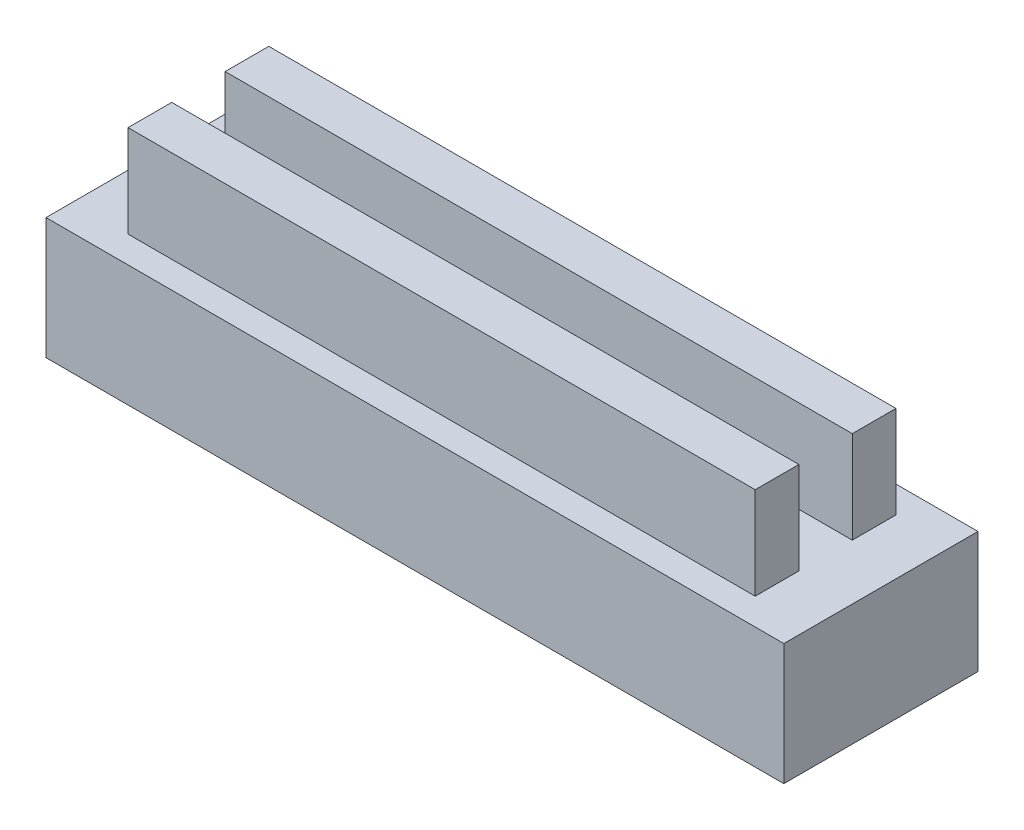
ISO-10303-21;
HEADER;
FILE_DESCRIPTION(('STEP AP214'),'2;1');
FILE_NAME('part.step','',(''),(''),'','','');
FILE_SCHEMA(('AUTOMOTIVE_DESIGN { 1 0 10303 214 1 1 1 1 }'));
ENDSEC;
DATA;
#1=APPLICATION_CONTEXT('core data for automotive mechanical design processes');
#2=APPLICATION_PROTOCOL_DEFINITION('international standard','automotive_design',2000,#1);
#3=PRODUCT_CONTEXT('',#1,'mechanical');
#4=PRODUCT('Part','Part','',(#3));
#5=PRODUCT_RELATED_PRODUCT_CATEGORY('part','',(#4));
#6=PRODUCT_DEFINITION_FORMATION('','',#4);
#7=PRODUCT_DEFINITION_CONTEXT('part definition',#1,'design');
#8=PRODUCT_DEFINITION('design','',#6,#7);
#9=PRODUCT_DEFINITION_SHAPE('','',#8);
#10=(LENGTH_UNIT() NAMED_UNIT(*) SI_UNIT(.MILLI.,.METRE.));
#11=(NAMED_UNIT(*) PLANE_ANGLE_UNIT() SI_UNIT($,.RADIAN.));
#12=(NAMED_UNIT(*) SI_UNIT($,.STERADIAN.) SOLID_ANGLE_UNIT());
#13=UNCERTAINTY_MEASURE_WITH_UNIT(LENGTH_MEASURE(1.E-05),#10,'distance_accuracy_value','');
#14=(GEOMETRIC_REPRESENTATION_CONTEXT(3) GLOBAL_UNCERTAINTY_ASSIGNED_CONTEXT((#13)) GLOBAL_UNIT_ASSIGNED_CONTEXT((#10,
#11,#12)) REPRESENTATION_CONTEXT('',''));
#15=CARTESIAN_POINT('',(0.,0.,0.));
#16=DIRECTION('',(0.,0.,1.));
#17=DIRECTION('',(1.,0.,0.));
#18=AXIS2_PLACEMENT_3D('',#15,#16,#17);
#19=CARTESIAN_POINT('',(0.,2.5,0.));
#20=DIRECTION('',(0.,1.,0.));
#21=DIRECTION('',(0.,0.,1.));
#22=AXIS2_PLACEMENT_3D('',#19,#20,#21);
#23=PLANE('',#22);
#24=DIRECTION('',(0.,0.,1.));
#25=VECTOR('',#24,1.);
#26=CARTESIAN_POINT('',(-7.6,2.5,2.));
#27=LINE('',#26,#25);
#28=CARTESIAN_POINT('',(-7.6,2.5,-2.));
#29=VERTEX_POINT('',#28);
#30=CARTESIAN_POINT('',(-7.6,2.5,2.));
#31=VERTEX_POINT('',#30);
#32=EDGE_CURVE('E180',#29,#31,#27,.T.);
#33=ORIENTED_EDGE('',*,*,#32,.T.);
#34=DIRECTION('',(1.,0.,0.));
#35=VECTOR('',#34,1.);
#36=CARTESIAN_POINT('',(7.6,2.5,2.));
#37=LINE('',#36,#35);
#38=CARTESIAN_POINT('',(7.6,2.5,2.));
#39=VERTEX_POINT('',#38);
#40=EDGE_CURVE('E183',#31,#39,#37,.T.);
#41=ORIENTED_EDGE('',*,*,#40,.T.);
#42=DIRECTION('',(0.,0.,-1.));
#43=VECTOR('',#42,1.);
#44=CARTESIAN_POINT('',(7.6,2.5,2.));
#45=LINE('',#44,#43);
#46=CARTESIAN_POINT('',(7.6,2.5,-2.));
#47=VERTEX_POINT('',#46);
#48=EDGE_CURVE('E186',#39,#47,#45,.T.);
#49=ORIENTED_EDGE('',*,*,#48,.T.);
#50=DIRECTION('',(-1.,0.,0.));
#51=VECTOR('',#50,1.);
#52=CARTESIAN_POINT('',(7.6,2.5,-2.));
#53=LINE('',#52,#51);
#54=EDGE_CURVE('E188',#47,#29,#53,.T.);
#55=ORIENTED_EDGE('',*,*,#54,.T.);
#56=EDGE_LOOP('',(#33,#41,#49,#55));
#57=FACE_BOUND('',#56,.T.);
#58=DIRECTION('',(1.,0.,0.));
#59=VECTOR('',#58,1.);
#60=CARTESIAN_POINT('',(6.46,2.5,1.45));
#61=LINE('',#60,#59);
#62=CARTESIAN_POINT('',(-6.46,2.5,1.45));
#63=VERTEX_POINT('',#62);
#64=CARTESIAN_POINT('',(6.46,2.5,1.45));
#65=VERTEX_POINT('',#64);
#66=EDGE_CURVE('E151',#63,#65,#61,.T.);
#67=ORIENTED_EDGE('',*,*,#66,.F.);
#68=DIRECTION('',(0.,0.,1.));
#69=VECTOR('',#68,1.);
#70=CARTESIAN_POINT('',(-6.46,2.5,1.45));
#71=LINE('',#70,#69);
#72=CARTESIAN_POINT('',(-6.46,2.5,0.550000000000001));
#73=VERTEX_POINT('',#72);
#74=EDGE_CURVE('E148',#73,#63,#71,.T.);
#75=ORIENTED_EDGE('',*,*,#74,.F.);
#76=DIRECTION('',(-1.,0.,0.));
#77=VECTOR('',#76,1.);
#78=CARTESIAN_POINT('',(6.46,2.5,0.550000000000001));
#79=LINE('',#78,#77);
#80=CARTESIAN_POINT('',(6.46,2.5,0.550000000000001));
#81=VERTEX_POINT('',#80);
#82=EDGE_CURVE('E160',#81,#73,#79,.T.);
#83=ORIENTED_EDGE('',*,*,#82,.F.);
#84=DIRECTION('',(0.,0.,-1.));
#85=VECTOR('',#84,1.);
#86=CARTESIAN_POINT('',(6.46,2.5,1.45));
#87=LINE('',#86,#85);
#88=EDGE_CURVE('E168',#65,#81,#87,.T.);
#89=ORIENTED_EDGE('',*,*,#88,.F.);
#90=EDGE_LOOP('',(#67,#75,#83,#89));
#91=FACE_BOUND('',#90,.T.);
#92=DIRECTION('',(1.,0.,0.));
#93=VECTOR('',#92,1.);
#94=CARTESIAN_POINT('',(6.46,2.5,-0.550000000000001));
#95=LINE('',#94,#93);
#96=CARTESIAN_POINT('',(-6.46,2.5,-0.550000000000001));
#97=VERTEX_POINT('',#96);
#98=CARTESIAN_POINT('',(6.46,2.5,-0.550000000000001));
#99=VERTEX_POINT('',#98);
#100=EDGE_CURVE('E369',#97,#99,#95,.T.);
#101=ORIENTED_EDGE('',*,*,#100,.F.);
#102=DIRECTION('',(0.,0.,1.));
#103=VECTOR('',#102,1.);
#104=CARTESIAN_POINT('',(-6.46,2.5,-0.550000000000001));
#105=LINE('',#104,#103);
#106=CARTESIAN_POINT('',(-6.46,2.5,-1.45));
#107=VERTEX_POINT('',#106);
#108=EDGE_CURVE('E146',#107,#97,#105,.T.);
#109=ORIENTED_EDGE('',*,*,#108,.F.);
#110=DIRECTION('',(-1.,0.,0.));
#111=VECTOR('',#110,1.);
#112=CARTESIAN_POINT('',(6.46,2.5,-1.45));
#113=LINE('',#112,#111);
#114=CARTESIAN_POINT('',(6.46,2.5,-1.45));
#115=VERTEX_POINT('',#114);
#116=EDGE_CURVE('E142',#115,#107,#113,.T.);
#117=ORIENTED_EDGE('',*,*,#116,.F.);
#118=DIRECTION('',(0.,0.,-1.));
#119=VECTOR('',#118,1.);
#120=CARTESIAN_POINT('',(6.46,2.5,-0.550000000000001));
#121=LINE('',#120,#119);
#122=EDGE_CURVE('E366',#99,#115,#121,.T.);
#123=ORIENTED_EDGE('',*,*,#122,.F.);
#124=EDGE_LOOP('',(#101,#109,#117,#123));
#125=FACE_BOUND('',#124,.T.);
#126=ADVANCED_FACE('F33',(#57,#91,#125),#23,.T.);
#127=CARTESIAN_POINT('',(-7.6,2.5,2.));
#128=DIRECTION('',(1.,0.,0.));
#129=DIRECTION('',(0.,0.,-1.));
#130=AXIS2_PLACEMENT_3D('',#127,#128,#129);
#131=PLANE('',#130);
#132=DIRECTION('',(0.,0.,1.));
#133=VECTOR('',#132,1.);
#134=CARTESIAN_POINT('',(-7.6,0.,2.));
#135=LINE('',#134,#133);
#136=CARTESIAN_POINT('',(-7.6,0.,-2.));
#137=VERTEX_POINT('',#136);
#138=CARTESIAN_POINT('',(-7.6,0.,2.));
#139=VERTEX_POINT('',#138);
#140=EDGE_CURVE('E179',#137,#139,#135,.T.);
#141=ORIENTED_EDGE('',*,*,#140,.T.);
#142=DIRECTION('',(0.,-1.,0.));
#143=VECTOR('',#142,1.);
#144=CARTESIAN_POINT('',(-7.6,2.5,2.));
#145=LINE('',#144,#143);
#146=EDGE_CURVE('E11',#31,#139,#145,.T.);
#147=ORIENTED_EDGE('',*,*,#146,.F.);
#148=ORIENTED_EDGE('',*,*,#32,.F.);
#149=DIRECTION('',(0.,-1.,0.));
#150=VECTOR('',#149,1.);
#151=CARTESIAN_POINT('',(-7.6,2.5,-2.));
#152=LINE('',#151,#150);
#153=EDGE_CURVE('E190',#29,#137,#152,.T.);
#154=ORIENTED_EDGE('',*,*,#153,.T.);
#155=EDGE_LOOP('',(#141,#147,#148,#154));
#156=FACE_BOUND('',#155,.T.);
#157=ADVANCED_FACE('F35',(#156),#131,.F.);
#158=CARTESIAN_POINT('',(7.6,2.5,2.));
#159=DIRECTION('',(0.,0.,-1.));
#160=DIRECTION('',(-1.,0.,0.));
#161=AXIS2_PLACEMENT_3D('',#158,#159,#160);
#162=PLANE('',#161);
#163=DIRECTION('',(1.,0.,0.));
#164=VECTOR('',#163,1.);
#165=CARTESIAN_POINT('',(7.6,0.,2.));
#166=LINE('',#165,#164);
#167=CARTESIAN_POINT('',(7.6,0.,2.));
#168=VERTEX_POINT('',#167);
#169=EDGE_CURVE('E193',#139,#168,#166,.T.);
#170=ORIENTED_EDGE('',*,*,#169,.T.);
#171=DIRECTION('',(0.,-1.,0.));
#172=VECTOR('',#171,1.);
#173=CARTESIAN_POINT('',(7.6,2.5,2.));
#174=LINE('',#173,#172);
#175=EDGE_CURVE('E41',#39,#168,#174,.T.);
#176=ORIENTED_EDGE('',*,*,#175,.F.);
#177=ORIENTED_EDGE('',*,*,#40,.F.);
#178=ORIENTED_EDGE('',*,*,#146,.T.);
#179=EDGE_LOOP('',(#170,#176,#177,#178));
#180=FACE_BOUND('',#179,.T.);
#181=ADVANCED_FACE('F223',(#180),#162,.F.);
#182=CARTESIAN_POINT('',(7.6,2.5,2.));
#183=DIRECTION('',(-1.,0.,0.));
#184=DIRECTION('',(0.,0.,1.));
#185=AXIS2_PLACEMENT_3D('',#182,#183,#184);
#186=PLANE('',#185);
#187=DIRECTION('',(0.,0.,-1.));
#188=VECTOR('',#187,1.);
#189=CARTESIAN_POINT('',(7.6,0.,2.));
#190=LINE('',#189,#188);
#191=CARTESIAN_POINT('',(7.6,0.,-2.));
#192=VERTEX_POINT('',#191);
#193=EDGE_CURVE('E195',#168,#192,#190,.T.);
#194=ORIENTED_EDGE('',*,*,#193,.T.);
#195=DIRECTION('',(0.,-1.,0.));
#196=VECTOR('',#195,1.);
#197=CARTESIAN_POINT('',(7.6,2.5,-2.));
#198=LINE('',#197,#196);
#199=EDGE_CURVE('E200',#47,#192,#198,.T.);
#200=ORIENTED_EDGE('',*,*,#199,.F.);
#201=ORIENTED_EDGE('',*,*,#48,.F.);
#202=ORIENTED_EDGE('',*,*,#175,.T.);
#203=EDGE_LOOP('',(#194,#200,#201,#202));
#204=FACE_BOUND('',#203,.T.);
#205=ADVANCED_FACE('F207',(#204),#186,.F.);
#206=CARTESIAN_POINT('',(7.6,2.5,-2.));
#207=DIRECTION('',(0.,0.,1.));
#208=DIRECTION('',(1.,0.,0.));
#209=AXIS2_PLACEMENT_3D('',#206,#207,#208);
#210=PLANE('',#209);
#211=DIRECTION('',(-1.,0.,0.));
#212=VECTOR('',#211,1.);
#213=CARTESIAN_POINT('',(7.6,0.,-2.));
#214=LINE('',#213,#212);
#215=EDGE_CURVE('E184',#192,#137,#214,.T.);
#216=ORIENTED_EDGE('',*,*,#215,.T.);
#217=ORIENTED_EDGE('',*,*,#153,.F.);
#218=ORIENTED_EDGE('',*,*,#54,.F.);
#219=ORIENTED_EDGE('',*,*,#199,.T.);
#220=EDGE_LOOP('',(#216,#217,#218,#219));
#221=FACE_BOUND('',#220,.T.);
#222=ADVANCED_FACE('F216',(#221),#210,.F.);
#223=CARTESIAN_POINT('',(0.,0.,0.));
#224=DIRECTION('',(0.,1.,0.));
#225=DIRECTION('',(0.,0.,1.));
#226=AXIS2_PLACEMENT_3D('',#223,#224,#225);
#227=PLANE('',#226);
#228=ORIENTED_EDGE('',*,*,#140,.F.);
#229=ORIENTED_EDGE('',*,*,#215,.F.);
#230=ORIENTED_EDGE('',*,*,#193,.F.);
#231=ORIENTED_EDGE('',*,*,#169,.F.);
#232=EDGE_LOOP('',(#228,#229,#230,#231));
#233=FACE_BOUND('',#232,.T.);
#234=ADVANCED_FACE('F213',(#233),#227,.F.);
#235=CARTESIAN_POINT('',(-6.46,4.4,1.45));
#236=DIRECTION('',(1.,0.,0.));
#237=DIRECTION('',(0.,0.,-1.));
#238=AXIS2_PLACEMENT_3D('',#235,#236,#237);
#239=PLANE('',#238);
#240=ORIENTED_EDGE('',*,*,#74,.T.);
#241=DIRECTION('',(0.,-1.,0.));
#242=VECTOR('',#241,1.);
#243=CARTESIAN_POINT('',(-6.46,4.4,1.45));
#244=LINE('',#243,#242);
#245=CARTESIAN_POINT('',(-6.46,4.4,1.45));
#246=VERTEX_POINT('',#245);
#247=EDGE_CURVE('E177',#246,#63,#244,.T.);
#248=ORIENTED_EDGE('',*,*,#247,.F.);
#249=DIRECTION('',(0.,0.,1.));
#250=VECTOR('',#249,1.);
#251=CARTESIAN_POINT('',(-6.46,4.4,1.45));
#252=LINE('',#251,#250);
#253=CARTESIAN_POINT('',(-6.46,4.4,0.550000000000001));
#254=VERTEX_POINT('',#253);
#255=EDGE_CURVE('E156',#254,#246,#252,.T.);
#256=ORIENTED_EDGE('',*,*,#255,.F.);
#257=DIRECTION('',(0.,-1.,0.));
#258=VECTOR('',#257,1.);
#259=CARTESIAN_POINT('',(-6.46,4.4,0.550000000000001));
#260=LINE('',#259,#258);
#261=EDGE_CURVE('E165',#254,#73,#260,.T.);
#262=ORIENTED_EDGE('',*,*,#261,.T.);
#263=EDGE_LOOP('',(#240,#248,#256,#262));
#264=FACE_BOUND('',#263,.T.);
#265=ADVANCED_FACE('F236',(#264),#239,.F.);
#266=CARTESIAN_POINT('',(6.46,4.4,1.45));
#267=DIRECTION('',(0.,0.,-1.));
#268=DIRECTION('',(-1.,0.,0.));
#269=AXIS2_PLACEMENT_3D('',#266,#267,#268);
#270=PLANE('',#269);
#271=ORIENTED_EDGE('',*,*,#66,.T.);
#272=DIRECTION('',(0.,-1.,0.));
#273=VECTOR('',#272,1.);
#274=CARTESIAN_POINT('',(6.46,4.4,1.45));
#275=LINE('',#274,#273);
#276=CARTESIAN_POINT('',(6.46,4.4,1.45));
#277=VERTEX_POINT('',#276);
#278=EDGE_CURVE('E174',#277,#65,#275,.T.);
#279=ORIENTED_EDGE('',*,*,#278,.F.);
#280=DIRECTION('',(1.,0.,0.));
#281=VECTOR('',#280,1.);
#282=CARTESIAN_POINT('',(6.46,4.4,1.45));
#283=LINE('',#282,#281);
#284=EDGE_CURVE('E159',#246,#277,#283,.T.);
#285=ORIENTED_EDGE('',*,*,#284,.F.);
#286=ORIENTED_EDGE('',*,*,#247,.T.);
#287=EDGE_LOOP('',(#271,#279,#285,#286));
#288=FACE_BOUND('',#287,.T.);
#289=ADVANCED_FACE('F255',(#288),#270,.F.);
#290=CARTESIAN_POINT('',(6.46,4.4,1.45));
#291=DIRECTION('',(-1.,0.,0.));
#292=DIRECTION('',(0.,0.,1.));
#293=AXIS2_PLACEMENT_3D('',#290,#291,#292);
#294=PLANE('',#293);
#295=ORIENTED_EDGE('',*,*,#88,.T.);
#296=DIRECTION('',(0.,-1.,0.));
#297=VECTOR('',#296,1.);
#298=CARTESIAN_POINT('',(6.46,4.4,0.550000000000001));
#299=LINE('',#298,#297);
#300=CARTESIAN_POINT('',(6.46,4.4,0.550000000000001));
#301=VERTEX_POINT('',#300);
#302=EDGE_CURVE('E56',#301,#81,#299,.T.);
#303=ORIENTED_EDGE('',*,*,#302,.F.);
#304=DIRECTION('',(0.,0.,-1.));
#305=VECTOR('',#304,1.);
#306=CARTESIAN_POINT('',(6.46,4.4,1.45));
#307=LINE('',#306,#305);
#308=EDGE_CURVE('E162',#277,#301,#307,.T.);
#309=ORIENTED_EDGE('',*,*,#308,.F.);
#310=ORIENTED_EDGE('',*,*,#278,.T.);
#311=EDGE_LOOP('',(#295,#303,#309,#310));
#312=FACE_BOUND('',#311,.T.);
#313=ADVANCED_FACE('F262',(#312),#294,.F.);
#314=CARTESIAN_POINT('',(6.46,4.4,0.550000000000001));
#315=DIRECTION('',(0.,0.,1.));
#316=DIRECTION('',(1.,0.,0.));
#317=AXIS2_PLACEMENT_3D('',#314,#315,#316);
#318=PLANE('',#317);
#319=ORIENTED_EDGE('',*,*,#82,.T.);
#320=ORIENTED_EDGE('',*,*,#261,.F.);
#321=DIRECTION('',(-1.,0.,0.));
#322=VECTOR('',#321,1.);
#323=CARTESIAN_POINT('',(6.46,4.4,0.550000000000001));
#324=LINE('',#323,#322);
#325=EDGE_CURVE('E164',#301,#254,#324,.T.);
#326=ORIENTED_EDGE('',*,*,#325,.F.);
#327=ORIENTED_EDGE('',*,*,#302,.T.);
#328=EDGE_LOOP('',(#319,#320,#326,#327));
#329=FACE_BOUND('',#328,.T.);
#330=ADVANCED_FACE('F269',(#329),#318,.F.);
#331=CARTESIAN_POINT('',(0.,4.4,0.));
#332=DIRECTION('',(0.,1.,0.));
#333=DIRECTION('',(0.,0.,1.));
#334=AXIS2_PLACEMENT_3D('',#331,#332,#333);
#335=PLANE('',#334);
#336=ORIENTED_EDGE('',*,*,#255,.T.);
#337=ORIENTED_EDGE('',*,*,#284,.T.);
#338=ORIENTED_EDGE('',*,*,#308,.T.);
#339=ORIENTED_EDGE('',*,*,#325,.T.);
#340=EDGE_LOOP('',(#336,#337,#338,#339));
#341=FACE_BOUND('',#340,.T.);
#342=ADVANCED_FACE('F277',(#341),#335,.T.);
#343=CARTESIAN_POINT('',(-6.46,4.4,-0.550000000000001));
#344=DIRECTION('',(1.,0.,0.));
#345=DIRECTION('',(0.,0.,-1.));
#346=AXIS2_PLACEMENT_3D('',#343,#344,#345);
#347=PLANE('',#346);
#348=ORIENTED_EDGE('',*,*,#108,.T.);
#349=DIRECTION('',(0.,-1.,0.));
#350=VECTOR('',#349,1.);
#351=CARTESIAN_POINT('',(-6.46,4.4,-0.550000000000001));
#352=LINE('',#351,#350);
#353=CARTESIAN_POINT('',(-6.46,4.4,-0.550000000000001));
#354=VERTEX_POINT('',#353);
#355=EDGE_CURVE('E127',#354,#97,#352,.T.);
#356=ORIENTED_EDGE('',*,*,#355,.F.);
#357=DIRECTION('',(0.,0.,1.));
#358=VECTOR('',#357,1.);
#359=CARTESIAN_POINT('',(-6.46,4.4,-0.550000000000001));
#360=LINE('',#359,#358);
#361=CARTESIAN_POINT('',(-6.46,4.4,-1.45));
#362=VERTEX_POINT('',#361);
#363=EDGE_CURVE('E134',#362,#354,#360,.T.);
#364=ORIENTED_EDGE('',*,*,#363,.F.);
#365=DIRECTION('',(0.,-1.,0.));
#366=VECTOR('',#365,1.);
#367=CARTESIAN_POINT('',(-6.46,4.4,-1.45));
#368=LINE('',#367,#366);
#369=EDGE_CURVE('E363',#362,#107,#368,.T.);
#370=ORIENTED_EDGE('',*,*,#369,.T.);
#371=EDGE_LOOP('',(#348,#356,#364,#370));
#372=FACE_BOUND('',#371,.T.);
#373=ADVANCED_FACE('F144',(#372),#347,.F.);
#374=CARTESIAN_POINT('',(6.46,4.4,-0.550000000000001));
#375=DIRECTION('',(0.,0.,-1.));
#376=DIRECTION('',(-1.,0.,0.));
#377=AXIS2_PLACEMENT_3D('',#374,#375,#376);
#378=PLANE('',#377);
#379=ORIENTED_EDGE('',*,*,#100,.T.);
#380=DIRECTION('',(0.,-1.,0.));
#381=VECTOR('',#380,1.);
#382=CARTESIAN_POINT('',(6.46,4.4,-0.550000000000001));
#383=LINE('',#382,#381);
#384=CARTESIAN_POINT('',(6.46,4.4,-0.550000000000001));
#385=VERTEX_POINT('',#384);
#386=EDGE_CURVE('E130',#385,#99,#383,.T.);
#387=ORIENTED_EDGE('',*,*,#386,.F.);
#388=DIRECTION('',(1.,0.,0.));
#389=VECTOR('',#388,1.);
#390=CARTESIAN_POINT('',(6.46,4.4,-0.550000000000001));
#391=LINE('',#390,#389);
#392=EDGE_CURVE('E123',#354,#385,#391,.T.);
#393=ORIENTED_EDGE('',*,*,#392,.F.);
#394=ORIENTED_EDGE('',*,*,#355,.T.);
#395=EDGE_LOOP('',(#379,#387,#393,#394));
#396=FACE_BOUND('',#395,.T.);
#397=ADVANCED_FACE('F125',(#396),#378,.F.);
#398=CARTESIAN_POINT('',(6.46,4.4,-0.550000000000001));
#399=DIRECTION('',(-1.,0.,0.));
#400=DIRECTION('',(0.,0.,1.));
#401=AXIS2_PLACEMENT_3D('',#398,#399,#400);
#402=PLANE('',#401);
#403=ORIENTED_EDGE('',*,*,#122,.T.);
#404=DIRECTION('',(0.,-1.,0.));
#405=VECTOR('',#404,1.);
#406=CARTESIAN_POINT('',(6.46,4.4,-1.45));
#407=LINE('',#406,#405);
#408=CARTESIAN_POINT('',(6.46,4.4,-1.45));
#409=VERTEX_POINT('',#408);
#410=EDGE_CURVE('E48',#409,#115,#407,.T.);
#411=ORIENTED_EDGE('',*,*,#410,.F.);
#412=DIRECTION('',(0.,0.,-1.));
#413=VECTOR('',#412,1.);
#414=CARTESIAN_POINT('',(6.46,4.4,-0.550000000000001));
#415=LINE('',#414,#413);
#416=EDGE_CURVE('E133',#385,#409,#415,.T.);
#417=ORIENTED_EDGE('',*,*,#416,.F.);
#418=ORIENTED_EDGE('',*,*,#386,.T.);
#419=EDGE_LOOP('',(#403,#411,#417,#418));
#420=FACE_BOUND('',#419,.T.);
#421=ADVANCED_FACE('F297',(#420),#402,.F.);
#422=CARTESIAN_POINT('',(6.46,4.4,-1.45));
#423=DIRECTION('',(0.,0.,1.));
#424=DIRECTION('',(1.,0.,0.));
#425=AXIS2_PLACEMENT_3D('',#422,#423,#424);
#426=PLANE('',#425);
#427=ORIENTED_EDGE('',*,*,#116,.T.);
#428=ORIENTED_EDGE('',*,*,#369,.F.);
#429=DIRECTION('',(-1.,0.,0.));
#430=VECTOR('',#429,1.);
#431=CARTESIAN_POINT('',(6.46,4.4,-1.45));
#432=LINE('',#431,#430);
#433=EDGE_CURVE('E138',#409,#362,#432,.T.);
#434=ORIENTED_EDGE('',*,*,#433,.F.);
#435=ORIENTED_EDGE('',*,*,#410,.T.);
#436=EDGE_LOOP('',(#427,#428,#434,#435));
#437=FACE_BOUND('',#436,.T.);
#438=ADVANCED_FACE('F304',(#437),#426,.F.);
#439=CARTESIAN_POINT('',(0.,4.4,0.));
#440=DIRECTION('',(0.,1.,0.));
#441=DIRECTION('',(0.,0.,1.));
#442=AXIS2_PLACEMENT_3D('',#439,#440,#441);
#443=PLANE('',#442);
#444=ORIENTED_EDGE('',*,*,#363,.T.);
#445=ORIENTED_EDGE('',*,*,#392,.T.);
#446=ORIENTED_EDGE('',*,*,#416,.T.);
#447=ORIENTED_EDGE('',*,*,#433,.T.);
#448=EDGE_LOOP('',(#444,#445,#446,#447));
#449=FACE_BOUND('',#448,.T.);
#450=ADVANCED_FACE('F137',(#449),#443,.T.);
#451=CLOSED_SHELL('',(#126,#157,#181,#205,#222,#234,#265,#289,#313,#330,#342,#373,#397,#421,
#438,#450));
#452=MANIFOLD_SOLID_BREP('B2',#451);
#453=ADVANCED_BREP_SHAPE_REPRESENTATION('',(#18,#452),#14);
#454=SHAPE_DEFINITION_REPRESENTATION(#9,#453);
ENDSEC;
END-ISO-10303-21;
